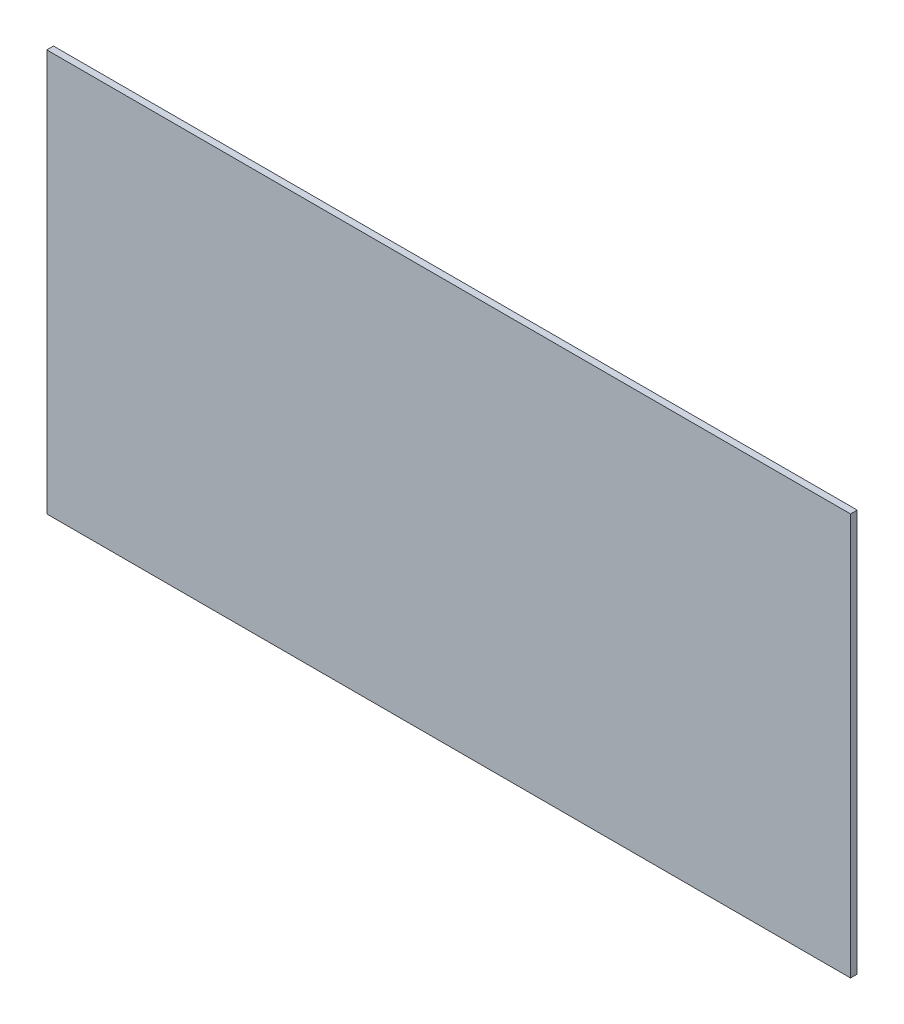
ISO-10303-21;
HEADER;
FILE_DESCRIPTION(('STEP AP214'),'2;1');
FILE_NAME('part.step','',(''),(''),'','','');
FILE_SCHEMA(('AUTOMOTIVE_DESIGN { 1 0 10303 214 1 1 1 1 }'));
ENDSEC;
DATA;
#1=APPLICATION_CONTEXT('core data for automotive mechanical design processes');
#2=APPLICATION_PROTOCOL_DEFINITION('international standard','automotive_design',2000,#1);
#3=PRODUCT_CONTEXT('',#1,'mechanical');
#4=PRODUCT('Part','Part','',(#3));
#5=PRODUCT_RELATED_PRODUCT_CATEGORY('part','',(#4));
#6=PRODUCT_DEFINITION_FORMATION('','',#4);
#7=PRODUCT_DEFINITION_CONTEXT('part definition',#1,'design');
#8=PRODUCT_DEFINITION('design','',#6,#7);
#9=PRODUCT_DEFINITION_SHAPE('','',#8);
#10=(LENGTH_UNIT() NAMED_UNIT(*) SI_UNIT(.MILLI.,.METRE.));
#11=(NAMED_UNIT(*) PLANE_ANGLE_UNIT() SI_UNIT($,.RADIAN.));
#12=(NAMED_UNIT(*) SI_UNIT($,.STERADIAN.) SOLID_ANGLE_UNIT());
#13=UNCERTAINTY_MEASURE_WITH_UNIT(LENGTH_MEASURE(1.E-05),#10,'distance_accuracy_value','');
#14=(GEOMETRIC_REPRESENTATION_CONTEXT(3) GLOBAL_UNCERTAINTY_ASSIGNED_CONTEXT((#13)) GLOBAL_UNIT_ASSIGNED_CONTEXT((#10,
#11,#12)) REPRESENTATION_CONTEXT('',''));
#15=CARTESIAN_POINT('',(0.,0.,0.));
#16=DIRECTION('',(0.,0.,1.));
#17=DIRECTION('',(1.,0.,0.));
#18=AXIS2_PLACEMENT_3D('',#15,#16,#17);
#19=CARTESIAN_POINT('',(0.,0.,-1.));
#20=DIRECTION('',(-1.,0.,0.));
#21=DIRECTION('',(0.,-1.,0.));
#22=AXIS2_PLACEMENT_3D('',#19,#20,#21);
#23=PLANE('',#22);
#24=DIRECTION('',(0.,-1.,0.));
#25=VECTOR('',#24,1.);
#26=CARTESIAN_POINT('',(0.,0.,0.));
#27=LINE('',#26,#25);
#28=CARTESIAN_POINT('',(0.,60.,0.));
#29=VERTEX_POINT('',#28);
#30=CARTESIAN_POINT('',(0.,0.,0.));
#31=VERTEX_POINT('',#30);
#32=EDGE_CURVE('E102',#29,#31,#27,.T.);
#33=ORIENTED_EDGE('',*,*,#32,.F.);
#34=DIRECTION('',(0.,0.,1.));
#35=VECTOR('',#34,1.);
#36=CARTESIAN_POINT('',(0.,60.,-1.));
#37=LINE('',#36,#35);
#38=CARTESIAN_POINT('',(0.,60.,-1.));
#39=VERTEX_POINT('',#38);
#40=EDGE_CURVE('E11',#39,#29,#37,.T.);
#41=ORIENTED_EDGE('',*,*,#40,.F.);
#42=DIRECTION('',(0.,-1.,0.));
#43=VECTOR('',#42,1.);
#44=CARTESIAN_POINT('',(0.,0.,-1.));
#45=LINE('',#44,#43);
#46=CARTESIAN_POINT('',(0.,0.,-1.));
#47=VERTEX_POINT('',#46);
#48=EDGE_CURVE('E96',#39,#47,#45,.T.);
#49=ORIENTED_EDGE('',*,*,#48,.T.);
#50=DIRECTION('',(0.,0.,1.));
#51=VECTOR('',#50,1.);
#52=CARTESIAN_POINT('',(0.,0.,-1.));
#53=LINE('',#52,#51);
#54=EDGE_CURVE('E41',#47,#31,#53,.T.);
#55=ORIENTED_EDGE('',*,*,#54,.T.);
#56=EDGE_LOOP('',(#33,#41,#49,#55));
#57=FACE_BOUND('',#56,.T.);
#58=ADVANCED_FACE('F38',(#57),#23,.T.);
#59=CARTESIAN_POINT('',(0.,60.,-1.));
#60=DIRECTION('',(0.,1.,0.));
#61=DIRECTION('',(0.,0.,1.));
#62=AXIS2_PLACEMENT_3D('',#59,#60,#61);
#63=PLANE('',#62);
#64=DIRECTION('',(-1.,0.,0.));
#65=VECTOR('',#64,1.);
#66=CARTESIAN_POINT('',(0.,60.,0.));
#67=LINE('',#66,#65);
#68=CARTESIAN_POINT('',(120.,60.,0.));
#69=VERTEX_POINT('',#68);
#70=EDGE_CURVE('E98',#69,#29,#67,.T.);
#71=ORIENTED_EDGE('',*,*,#70,.F.);
#72=DIRECTION('',(0.,0.,1.));
#73=VECTOR('',#72,1.);
#74=CARTESIAN_POINT('',(120.,60.,-1.));
#75=LINE('',#74,#73);
#76=CARTESIAN_POINT('',(120.,60.,-1.));
#77=VERTEX_POINT('',#76);
#78=EDGE_CURVE('E47',#77,#69,#75,.T.);
#79=ORIENTED_EDGE('',*,*,#78,.F.);
#80=DIRECTION('',(-1.,0.,0.));
#81=VECTOR('',#80,1.);
#82=CARTESIAN_POINT('',(0.,60.,-1.));
#83=LINE('',#82,#81);
#84=EDGE_CURVE('E93',#77,#39,#83,.T.);
#85=ORIENTED_EDGE('',*,*,#84,.T.);
#86=ORIENTED_EDGE('',*,*,#40,.T.);
#87=EDGE_LOOP('',(#71,#79,#85,#86));
#88=FACE_BOUND('',#87,.T.);
#89=ADVANCED_FACE('F112',(#88),#63,.T.);
#90=CARTESIAN_POINT('',(120.,0.,-1.));
#91=DIRECTION('',(1.,0.,0.));
#92=DIRECTION('',(0.,1.,0.));
#93=AXIS2_PLACEMENT_3D('',#90,#91,#92);
#94=PLANE('',#93);
#95=DIRECTION('',(0.,1.,0.));
#96=VECTOR('',#95,1.);
#97=CARTESIAN_POINT('',(120.,0.,0.));
#98=LINE('',#97,#96);
#99=CARTESIAN_POINT('',(120.,0.,0.));
#100=VERTEX_POINT('',#99);
#101=EDGE_CURVE('E88',#100,#69,#98,.T.);
#102=ORIENTED_EDGE('',*,*,#101,.F.);
#103=DIRECTION('',(0.,0.,1.));
#104=VECTOR('',#103,1.);
#105=CARTESIAN_POINT('',(120.,0.,-1.));
#106=LINE('',#105,#104);
#107=CARTESIAN_POINT('',(120.,0.,-1.));
#108=VERTEX_POINT('',#107);
#109=EDGE_CURVE('E83',#108,#100,#106,.T.);
#110=ORIENTED_EDGE('',*,*,#109,.F.);
#111=DIRECTION('',(0.,1.,0.));
#112=VECTOR('',#111,1.);
#113=CARTESIAN_POINT('',(120.,0.,-1.));
#114=LINE('',#113,#112);
#115=EDGE_CURVE('E86',#108,#77,#114,.T.);
#116=ORIENTED_EDGE('',*,*,#115,.T.);
#117=ORIENTED_EDGE('',*,*,#78,.T.);
#118=EDGE_LOOP('',(#102,#110,#116,#117));
#119=FACE_BOUND('',#118,.T.);
#120=ADVANCED_FACE('F85',(#119),#94,.T.);
#121=CARTESIAN_POINT('',(0.,0.,-1.));
#122=DIRECTION('',(0.,-1.,0.));
#123=DIRECTION('',(0.,0.,-1.));
#124=AXIS2_PLACEMENT_3D('',#121,#122,#123);
#125=PLANE('',#124);
#126=DIRECTION('',(1.,0.,0.));
#127=VECTOR('',#126,1.);
#128=CARTESIAN_POINT('',(0.,0.,0.));
#129=LINE('',#128,#127);
#130=EDGE_CURVE('E105',#31,#100,#129,.T.);
#131=ORIENTED_EDGE('',*,*,#130,.F.);
#132=ORIENTED_EDGE('',*,*,#54,.F.);
#133=DIRECTION('',(1.,0.,0.));
#134=VECTOR('',#133,1.);
#135=CARTESIAN_POINT('',(0.,0.,-1.));
#136=LINE('',#135,#134);
#137=EDGE_CURVE('E92',#47,#108,#136,.T.);
#138=ORIENTED_EDGE('',*,*,#137,.T.);
#139=ORIENTED_EDGE('',*,*,#109,.T.);
#140=EDGE_LOOP('',(#131,#132,#138,#139));
#141=FACE_BOUND('',#140,.T.);
#142=ADVANCED_FACE('F95',(#141),#125,.T.);
#143=CARTESIAN_POINT('',(0.,0.,-1.));
#144=DIRECTION('',(0.,0.,-1.));
#145=DIRECTION('',(-1.,0.,0.));
#146=AXIS2_PLACEMENT_3D('',#143,#144,#145);
#147=PLANE('',#146);
#148=ORIENTED_EDGE('',*,*,#48,.F.);
#149=ORIENTED_EDGE('',*,*,#84,.F.);
#150=ORIENTED_EDGE('',*,*,#115,.F.);
#151=ORIENTED_EDGE('',*,*,#137,.F.);
#152=EDGE_LOOP('',(#148,#149,#150,#151));
#153=FACE_BOUND('',#152,.T.);
#154=ADVANCED_FACE('F91',(#153),#147,.T.);
#155=CARTESIAN_POINT('',(0.,0.,0.));
#156=DIRECTION('',(0.,0.,-1.));
#157=DIRECTION('',(-1.,0.,0.));
#158=AXIS2_PLACEMENT_3D('',#155,#156,#157);
#159=PLANE('',#158);
#160=ORIENTED_EDGE('',*,*,#32,.T.);
#161=ORIENTED_EDGE('',*,*,#130,.T.);
#162=ORIENTED_EDGE('',*,*,#101,.T.);
#163=ORIENTED_EDGE('',*,*,#70,.T.);
#164=EDGE_LOOP('',(#160,#161,#162,#163));
#165=FACE_BOUND('',#164,.T.);
#166=ADVANCED_FACE('F111',(#165),#159,.F.);
#167=CLOSED_SHELL('',(#58,#89,#120,#142,#154,#166));
#168=MANIFOLD_SOLID_BREP('B2',#167);
#169=ADVANCED_BREP_SHAPE_REPRESENTATION('',(#18,#168),#14);
#170=SHAPE_DEFINITION_REPRESENTATION(#9,#169);
ENDSEC;
END-ISO-10303-21;
